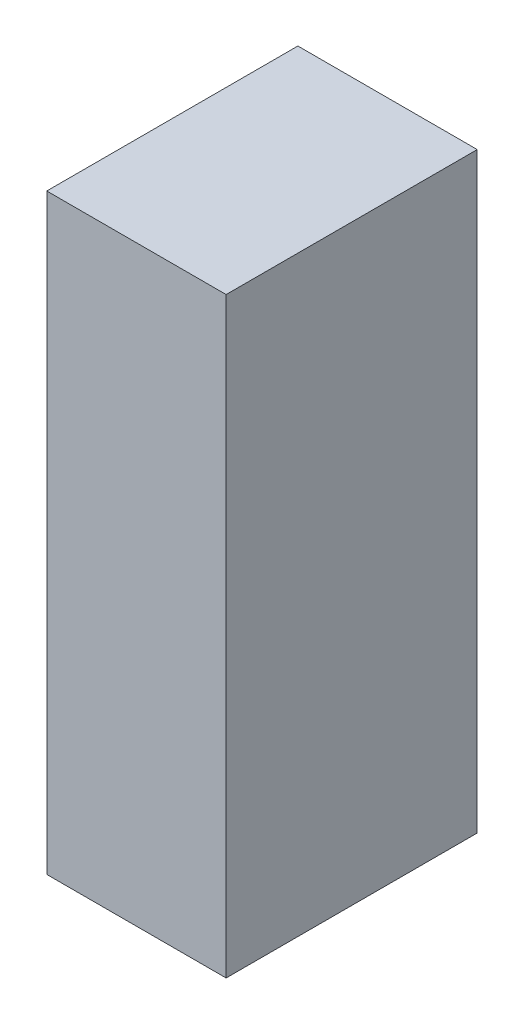
ISO-10303-21;
HEADER;
FILE_DESCRIPTION(('STEP AP214'),'2;1');
FILE_NAME('part.step','',(''),(''),'','','');
FILE_SCHEMA(('AUTOMOTIVE_DESIGN { 1 0 10303 214 1 1 1 1 }'));
ENDSEC;
DATA;
#1=APPLICATION_CONTEXT('core data for automotive mechanical design processes');
#2=APPLICATION_PROTOCOL_DEFINITION('international standard','automotive_design',2000,#1);
#3=PRODUCT_CONTEXT('',#1,'mechanical');
#4=PRODUCT('Part','Part','',(#3));
#5=PRODUCT_RELATED_PRODUCT_CATEGORY('part','',(#4));
#6=PRODUCT_DEFINITION_FORMATION('','',#4);
#7=PRODUCT_DEFINITION_CONTEXT('part definition',#1,'design');
#8=PRODUCT_DEFINITION('design','',#6,#7);
#9=PRODUCT_DEFINITION_SHAPE('','',#8);
#10=(LENGTH_UNIT() NAMED_UNIT(*) SI_UNIT(.MILLI.,.METRE.));
#11=(NAMED_UNIT(*) PLANE_ANGLE_UNIT() SI_UNIT($,.RADIAN.));
#12=(NAMED_UNIT(*) SI_UNIT($,.STERADIAN.) SOLID_ANGLE_UNIT());
#13=UNCERTAINTY_MEASURE_WITH_UNIT(LENGTH_MEASURE(1.E-05),#10,'distance_accuracy_value','');
#14=(GEOMETRIC_REPRESENTATION_CONTEXT(3) GLOBAL_UNCERTAINTY_ASSIGNED_CONTEXT((#13)) GLOBAL_UNIT_ASSIGNED_CONTEXT((#10,
#11,#12)) REPRESENTATION_CONTEXT('',''));
#15=CARTESIAN_POINT('',(0.,0.,0.));
#16=DIRECTION('',(0.,0.,1.));
#17=DIRECTION('',(1.,0.,0.));
#18=AXIS2_PLACEMENT_3D('',#15,#16,#17);
#19=CARTESIAN_POINT('',(-1.6250106513133,-0.825011065223862,-2.84112203121185));
#20=DIRECTION('',(-1.19248806385031E-08,-1.,0.));
#21=DIRECTION('',(1.,-1.19248806385031E-08,0.));
#22=AXIS2_PLACEMENT_3D('',#19,#20,#21);
#23=PLANE('',#22);
#24=DIRECTION('',(1.,-1.19248805337978E-08,0.));
#25=VECTOR('',#24,1.);
#26=CARTESIAN_POINT('',(-1.6250106513133,-0.825011065223862,-2.84112203121185));
#27=LINE('',#26,#25);
#28=CARTESIAN_POINT('',(-1.6250106513133,-0.825011065223862,-2.84112203121185));
#29=VERTEX_POINT('',#28);
#30=CARTESIAN_POINT('',(-1.12500302191877,-0.825011071186395,-2.84112203121185));
#31=VERTEX_POINT('',#30);
#32=EDGE_CURVE('E11',#29,#31,#27,.T.);
#33=ORIENTED_EDGE('',*,*,#32,.T.);
#34=DIRECTION('',(0.,0.,1.));
#35=VECTOR('',#34,1.);
#36=CARTESIAN_POINT('',(-1.12500302191877,-0.825011071186393,-2.84112203121185));
#37=LINE('',#36,#35);
#38=CARTESIAN_POINT('',(-1.12500302191877,-0.825011071186395,-2.14112091064453));
#39=VERTEX_POINT('',#38);
#40=EDGE_CURVE('E88',#31,#39,#37,.T.);
#41=ORIENTED_EDGE('',*,*,#40,.T.);
#42=DIRECTION('',(1.,-1.19248805337978E-08,0.));
#43=VECTOR('',#42,1.);
#44=CARTESIAN_POINT('',(-1.6250106513133,-0.825011065223862,-2.14112091064453));
#45=LINE('',#44,#43);
#46=CARTESIAN_POINT('',(-1.6250106513133,-0.825011065223862,-2.14112091064453));
#47=VERTEX_POINT('',#46);
#48=EDGE_CURVE('E83',#47,#39,#45,.T.);
#49=ORIENTED_EDGE('',*,*,#48,.F.);
#50=DIRECTION('',(0.,0.,1.));
#51=VECTOR('',#50,1.);
#52=CARTESIAN_POINT('',(-1.6250106513133,-0.825011065223861,-2.84112203121185));
#53=LINE('',#52,#51);
#54=EDGE_CURVE('E72',#29,#47,#53,.T.);
#55=ORIENTED_EDGE('',*,*,#54,.F.);
#56=EDGE_LOOP('',(#33,#41,#49,#55));
#57=FACE_BOUND('',#56,.T.);
#58=ADVANCED_FACE('F17',(#57),#23,.T.);
#59=CARTESIAN_POINT('',(-1.12500302191877,-0.825011071186395,-2.84112203121185));
#60=DIRECTION('',(1.,-1.19248806385031E-08,0.));
#61=DIRECTION('',(1.19248806385031E-08,1.,0.));
#62=AXIS2_PLACEMENT_3D('',#59,#60,#61);
#63=PLANE('',#62);
#64=DIRECTION('',(1.19248805831428E-08,1.,0.));
#65=VECTOR('',#64,1.);
#66=CARTESIAN_POINT('',(-1.12500302191877,-0.825011071186395,-2.84112203121185));
#67=LINE('',#66,#65);
#68=CARTESIAN_POINT('',(-1.12500300224279,0.82498282529798,-2.84112203121185));
#69=VERTEX_POINT('',#68);
#70=EDGE_CURVE('E24',#31,#69,#67,.T.);
#71=ORIENTED_EDGE('',*,*,#70,.T.);
#72=DIRECTION('',(0.,0.,1.));
#73=VECTOR('',#72,1.);
#74=CARTESIAN_POINT('',(-1.12500300224279,0.824982825297979,-2.84112203121185));
#75=LINE('',#74,#73);
#76=CARTESIAN_POINT('',(-1.12500300224279,0.82498282529798,-2.14112091064453));
#77=VERTEX_POINT('',#76);
#78=EDGE_CURVE('E85',#69,#77,#75,.T.);
#79=ORIENTED_EDGE('',*,*,#78,.T.);
#80=DIRECTION('',(1.19248805831428E-08,1.,0.));
#81=VECTOR('',#80,1.);
#82=CARTESIAN_POINT('',(-1.12500302191877,-0.825011071186395,-2.14112091064453));
#83=LINE('',#82,#81);
#84=EDGE_CURVE('E66',#39,#77,#83,.T.);
#85=ORIENTED_EDGE('',*,*,#84,.F.);
#86=ORIENTED_EDGE('',*,*,#40,.F.);
#87=EDGE_LOOP('',(#71,#79,#85,#86));
#88=FACE_BOUND('',#87,.T.);
#89=ADVANCED_FACE('F89',(#88),#63,.T.);
#90=CARTESIAN_POINT('',(-1.12500300224279,0.82498282529798,-2.84112203121185));
#91=DIRECTION('',(1.19248806385031E-08,1.,0.));
#92=DIRECTION('',(-1.,1.19248806385031E-08,0.));
#93=AXIS2_PLACEMENT_3D('',#90,#91,#92);
#94=PLANE('',#93);
#95=DIRECTION('',(-1.,1.19248805337978E-08,0.));
#96=VECTOR('',#95,1.);
#97=CARTESIAN_POINT('',(-1.12500300224279,0.82498282529798,-2.84112203121185));
#98=LINE('',#97,#96);
#99=CARTESIAN_POINT('',(-1.62501063163732,0.824982831260513,-2.84112203121185));
#100=VERTEX_POINT('',#99);
#101=EDGE_CURVE('E62',#69,#100,#98,.T.);
#102=ORIENTED_EDGE('',*,*,#101,.T.);
#103=DIRECTION('',(0.,0.,1.));
#104=VECTOR('',#103,1.);
#105=CARTESIAN_POINT('',(-1.62501063163732,0.824982831260511,-2.84112203121185));
#106=LINE('',#105,#104);
#107=CARTESIAN_POINT('',(-1.62501063163732,0.824982831260513,-2.14112091064453));
#108=VERTEX_POINT('',#107);
#109=EDGE_CURVE('E55',#100,#108,#106,.T.);
#110=ORIENTED_EDGE('',*,*,#109,.T.);
#111=DIRECTION('',(-1.,1.19248805337978E-08,0.));
#112=VECTOR('',#111,1.);
#113=CARTESIAN_POINT('',(-1.12500300224279,0.82498282529798,-2.14112091064453));
#114=LINE('',#113,#112);
#115=EDGE_CURVE('E59',#77,#108,#114,.T.);
#116=ORIENTED_EDGE('',*,*,#115,.F.);
#117=ORIENTED_EDGE('',*,*,#78,.F.);
#118=EDGE_LOOP('',(#102,#110,#116,#117));
#119=FACE_BOUND('',#118,.T.);
#120=ADVANCED_FACE('F57',(#119),#94,.T.);
#121=CARTESIAN_POINT('',(-1.62501063163732,0.824982831260513,-2.84112203121185));
#122=DIRECTION('',(-1.,1.19248806385031E-08,0.));
#123=DIRECTION('',(-1.19248806385031E-08,-1.,0.));
#124=AXIS2_PLACEMENT_3D('',#121,#122,#123);
#125=PLANE('',#124);
#126=DIRECTION('',(-1.19248805831428E-08,-1.,0.));
#127=VECTOR('',#126,1.);
#128=CARTESIAN_POINT('',(-1.62501063163732,0.824982831260513,-2.84112203121185));
#129=LINE('',#128,#127);
#130=EDGE_CURVE('E65',#100,#29,#129,.T.);
#131=ORIENTED_EDGE('',*,*,#130,.T.);
#132=ORIENTED_EDGE('',*,*,#54,.T.);
#133=DIRECTION('',(-1.19248805831428E-08,-1.,0.));
#134=VECTOR('',#133,1.);
#135=CARTESIAN_POINT('',(-1.62501063163732,0.824982831260513,-2.14112091064453));
#136=LINE('',#135,#134);
#137=EDGE_CURVE('E70',#108,#47,#136,.T.);
#138=ORIENTED_EDGE('',*,*,#137,.F.);
#139=ORIENTED_EDGE('',*,*,#109,.F.);
#140=EDGE_LOOP('',(#131,#132,#138,#139));
#141=FACE_BOUND('',#140,.T.);
#142=ADVANCED_FACE('F71',(#141),#125,.T.);
#143=CARTESIAN_POINT('',(94.1249923706055,-387.200012207031,-2.14112091064453));
#144=DIRECTION('',(0.,0.,1.));
#145=DIRECTION('',(1.19248806385031E-08,1.,0.));
#146=AXIS2_PLACEMENT_3D('',#143,#144,#145);
#147=PLANE('',#146);
#148=ORIENTED_EDGE('',*,*,#48,.T.);
#149=ORIENTED_EDGE('',*,*,#84,.T.);
#150=ORIENTED_EDGE('',*,*,#115,.T.);
#151=ORIENTED_EDGE('',*,*,#137,.T.);
#152=EDGE_LOOP('',(#148,#149,#150,#151));
#153=FACE_BOUND('',#152,.T.);
#154=ADVANCED_FACE('F76',(#153),#147,.T.);
#155=CARTESIAN_POINT('',(94.1249923706055,-387.200012207031,-2.84112203121185));
#156=DIRECTION('',(0.,0.,1.));
#157=DIRECTION('',(1.19248806385031E-08,1.,0.));
#158=AXIS2_PLACEMENT_3D('',#155,#156,#157);
#159=PLANE('',#158);
#160=ORIENTED_EDGE('',*,*,#130,.F.);
#161=ORIENTED_EDGE('',*,*,#101,.F.);
#162=ORIENTED_EDGE('',*,*,#70,.F.);
#163=ORIENTED_EDGE('',*,*,#32,.F.);
#164=EDGE_LOOP('',(#160,#161,#162,#163));
#165=FACE_BOUND('',#164,.T.);
#166=ADVANCED_FACE('F91',(#165),#159,.F.);
#167=CLOSED_SHELL('',(#58,#89,#120,#142,#154,#166));
#168=MANIFOLD_SOLID_BREP('B1',#167);
#169=ADVANCED_BREP_SHAPE_REPRESENTATION('',(#18,#168),#14);
#170=SHAPE_DEFINITION_REPRESENTATION(#9,#169);
ENDSEC;
END-ISO-10303-21;
